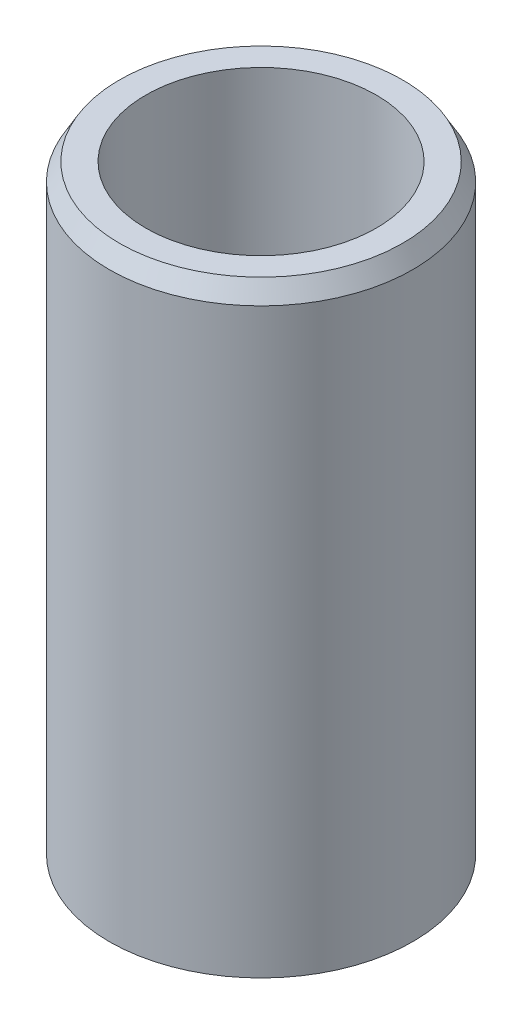
ISO-10303-21;
HEADER;
FILE_DESCRIPTION(('STEP AP214'),'2;1');
FILE_NAME('part.step','',(''),(''),'','','');
FILE_SCHEMA(('AUTOMOTIVE_DESIGN { 1 0 10303 214 1 1 1 1 }'));
ENDSEC;
DATA;
#1=APPLICATION_CONTEXT('core data for automotive mechanical design processes');
#2=APPLICATION_PROTOCOL_DEFINITION('international standard','automotive_design',2000,#1);
#3=PRODUCT_CONTEXT('',#1,'mechanical');
#4=PRODUCT('Part','Part','',(#3));
#5=PRODUCT_RELATED_PRODUCT_CATEGORY('part','',(#4));
#6=PRODUCT_DEFINITION_FORMATION('','',#4);
#7=PRODUCT_DEFINITION_CONTEXT('part definition',#1,'design');
#8=PRODUCT_DEFINITION('design','',#6,#7);
#9=PRODUCT_DEFINITION_SHAPE('','',#8);
#10=(LENGTH_UNIT() NAMED_UNIT(*) SI_UNIT(.MILLI.,.METRE.));
#11=(NAMED_UNIT(*) PLANE_ANGLE_UNIT() SI_UNIT($,.RADIAN.));
#12=(NAMED_UNIT(*) SI_UNIT($,.STERADIAN.) SOLID_ANGLE_UNIT());
#13=UNCERTAINTY_MEASURE_WITH_UNIT(LENGTH_MEASURE(1.E-05),#10,'distance_accuracy_value','');
#14=(GEOMETRIC_REPRESENTATION_CONTEXT(3) GLOBAL_UNCERTAINTY_ASSIGNED_CONTEXT((#13)) GLOBAL_UNIT_ASSIGNED_CONTEXT((#10,
#11,#12)) REPRESENTATION_CONTEXT('',''));
#15=CARTESIAN_POINT('',(0.,0.,0.));
#16=DIRECTION('',(0.,0.,1.));
#17=DIRECTION('',(1.,0.,0.));
#18=AXIS2_PLACEMENT_3D('',#15,#16,#17);
#19=CARTESIAN_POINT('',(0.,180.828768562641,0.));
#20=DIRECTION('',(0.,-1.,0.));
#21=DIRECTION('',(0.,0.,-1.));
#22=AXIS2_PLACEMENT_3D('',#19,#20,#21);
#23=CYLINDRICAL_SURFACE('',#22,45.);
#24=CARTESIAN_POINT('',(0.,175.586437153581,0.));
#25=DIRECTION('',(0.,1.,0.));
#26=DIRECTION('',(0.,0.,1.));
#27=AXIS2_PLACEMENT_3D('',#24,#25,#26);
#28=CIRCLE('',#27,45.);
#29=CARTESIAN_POINT('',(0.,175.586437153581,45.));
#30=VERTEX_POINT('',#29);
#31=EDGE_CURVE('E50',#30,#30,#28,.F.);
#32=ORIENTED_EDGE('',*,*,#31,.T.);
#33=EDGE_LOOP('',(#32));
#34=FACE_BOUND('',#33,.T.);
#35=CARTESIAN_POINT('',(0.,3.02666145020189,0.));
#36=DIRECTION('',(0.,1.,0.));
#37=DIRECTION('',(0.,0.,1.));
#38=AXIS2_PLACEMENT_3D('',#35,#36,#37);
#39=CIRCLE('',#38,45.);
#40=CARTESIAN_POINT('',(0.,3.02666145020189,45.));
#41=VERTEX_POINT('',#40);
#42=EDGE_CURVE('E51',#41,#41,#39,.T.);
#43=ORIENTED_EDGE('',*,*,#42,.T.);
#44=EDGE_LOOP('',(#43));
#45=FACE_BOUND('',#44,.T.);
#46=ADVANCED_FACE('F39',(#34,#45),#23,.T.);
#47=CARTESIAN_POINT('',(0.,180.828768562641,0.));
#48=DIRECTION('',(0.,1.,0.));
#49=DIRECTION('',(0.,0.,1.));
#50=AXIS2_PLACEMENT_3D('',#47,#48,#49);
#51=PLANE('',#50);
#52=CARTESIAN_POINT('',(0.,180.828768562641,0.));
#53=DIRECTION('',(0.,1.,0.));
#54=DIRECTION('',(0.,0.,1.));
#55=AXIS2_PLACEMENT_3D('',#52,#53,#54);
#56=CIRCLE('',#55,41.9733385497981);
#57=CARTESIAN_POINT('',(0.,180.828768562641,41.9733385497981));
#58=VERTEX_POINT('',#57);
#59=EDGE_CURVE('E54',#58,#58,#56,.T.);
#60=ORIENTED_EDGE('',*,*,#59,.T.);
#61=EDGE_LOOP('',(#60));
#62=FACE_BOUND('',#61,.T.);
#63=CARTESIAN_POINT('',(0.,180.828768562641,0.));
#64=DIRECTION('',(0.,1.,0.));
#65=DIRECTION('',(0.,0.,1.));
#66=AXIS2_PLACEMENT_3D('',#63,#64,#65);
#67=CIRCLE('',#66,34.1831218443325);
#68=CARTESIAN_POINT('',(0.,180.828768562641,34.1831218443325));
#69=VERTEX_POINT('',#68);
#70=EDGE_CURVE('E58',#69,#69,#67,.T.);
#71=ORIENTED_EDGE('',*,*,#70,.F.);
#72=EDGE_LOOP('',(#71));
#73=FACE_BOUND('',#72,.T.);
#74=ADVANCED_FACE('F69',(#62,#73),#51,.T.);
#75=CARTESIAN_POINT('',(0.,0.,0.));
#76=DIRECTION('',(0.,1.,0.));
#77=DIRECTION('',(0.,0.,1.));
#78=AXIS2_PLACEMENT_3D('',#75,#76,#77);
#79=PLANE('',#78);
#80=CARTESIAN_POINT('',(0.,0.,0.));
#81=DIRECTION('',(0.,1.,0.));
#82=DIRECTION('',(0.,0.,1.));
#83=AXIS2_PLACEMENT_3D('',#80,#81,#82);
#84=CIRCLE('',#83,39.7576685909402);
#85=CARTESIAN_POINT('',(0.,0.,39.7576685909402));
#86=VERTEX_POINT('',#85);
#87=EDGE_CURVE('E10',#86,#86,#84,.F.);
#88=ORIENTED_EDGE('',*,*,#87,.T.);
#89=EDGE_LOOP('',(#88));
#90=FACE_BOUND('',#89,.T.);
#91=CARTESIAN_POINT('',(0.,0.,0.));
#92=DIRECTION('',(0.,1.,0.));
#93=DIRECTION('',(0.,0.,1.));
#94=AXIS2_PLACEMENT_3D('',#91,#92,#93);
#95=CIRCLE('',#94,34.1831218443325);
#96=CARTESIAN_POINT('',(0.,0.,34.1831218443325));
#97=VERTEX_POINT('',#96);
#98=EDGE_CURVE('E63',#97,#97,#95,.T.);
#99=ORIENTED_EDGE('',*,*,#98,.T.);
#100=EDGE_LOOP('',(#99));
#101=FACE_BOUND('',#100,.T.);
#102=ADVANCED_FACE('F75',(#90,#101),#79,.F.);
#103=CARTESIAN_POINT('',(0.,180.828768562641,0.));
#104=DIRECTION('',(0.,-1.,0.));
#105=DIRECTION('',(0.,0.,-1.));
#106=AXIS2_PLACEMENT_3D('',#103,#104,#105);
#107=CYLINDRICAL_SURFACE('',#106,34.1831218443325);
#108=ORIENTED_EDGE('',*,*,#70,.T.);
#109=EDGE_LOOP('',(#108));
#110=FACE_BOUND('',#109,.T.);
#111=ORIENTED_EDGE('',*,*,#98,.F.);
#112=EDGE_LOOP('',(#111));
#113=FACE_BOUND('',#112,.T.);
#114=ADVANCED_FACE('F70',(#110,#113),#107,.F.);
#115=CARTESIAN_POINT('',(0.,180.828768562641,0.));
#116=DIRECTION('',(0.,-1.,0.));
#117=DIRECTION('',(0.,0.,-1.));
#118=AXIS2_PLACEMENT_3D('',#115,#116,#117);
#119=CONICAL_SURFACE('',#118,41.9733385497981,0.523598775598295);
#120=ORIENTED_EDGE('',*,*,#31,.F.);
#121=EDGE_LOOP('',(#120));
#122=FACE_BOUND('',#121,.T.);
#123=ORIENTED_EDGE('',*,*,#59,.F.);
#124=EDGE_LOOP('',(#123));
#125=FACE_BOUND('',#124,.T.);
#126=ADVANCED_FACE('F81',(#122,#125),#119,.T.);
#127=CARTESIAN_POINT('',(0.,3.02666145020189,0.));
#128=DIRECTION('',(0.,1.,0.));
#129=DIRECTION('',(0.,0.,1.));
#130=AXIS2_PLACEMENT_3D('',#127,#128,#129);
#131=CONICAL_SURFACE('',#130,45.,1.0471975511966);
#132=ORIENTED_EDGE('',*,*,#87,.F.);
#133=EDGE_LOOP('',(#132));
#134=FACE_BOUND('',#133,.T.);
#135=ORIENTED_EDGE('',*,*,#42,.F.);
#136=EDGE_LOOP('',(#135));
#137=FACE_BOUND('',#136,.T.);
#138=ADVANCED_FACE('F45',(#134,#137),#131,.T.);
#139=CLOSED_SHELL('',(#46,#74,#102,#114,#126,#138));
#140=MANIFOLD_SOLID_BREP('B2',#139);
#141=ADVANCED_BREP_SHAPE_REPRESENTATION('',(#18,#140),#14);
#142=SHAPE_DEFINITION_REPRESENTATION(#9,#141);
ENDSEC;
END-ISO-10303-21;
